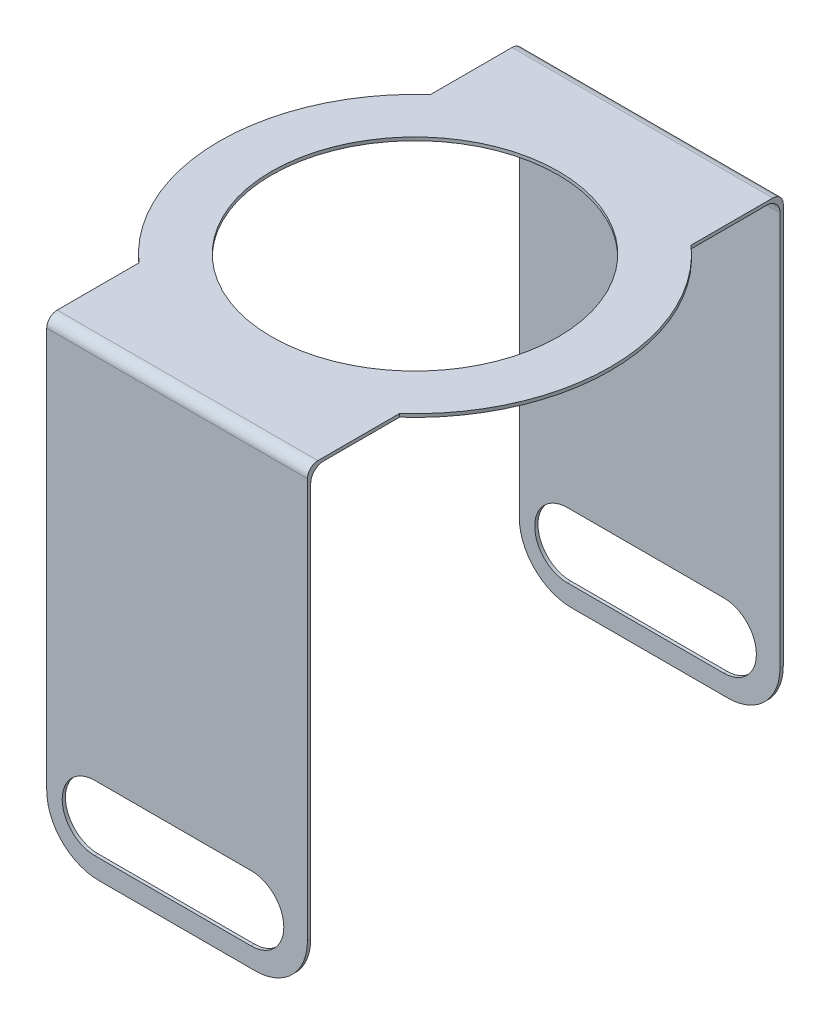
ISO-10303-21;
HEADER;
FILE_DESCRIPTION(('STEP AP214'),'2;1');
FILE_NAME('part.step','',(''),(''),'','','');
FILE_SCHEMA(('AUTOMOTIVE_DESIGN { 1 0 10303 214 1 1 1 1 }'));
ENDSEC;
DATA;
#1=APPLICATION_CONTEXT('core data for automotive mechanical design processes');
#2=APPLICATION_PROTOCOL_DEFINITION('international standard','automotive_design',2000,#1);
#3=PRODUCT_CONTEXT('',#1,'mechanical');
#4=PRODUCT('Part','Part','',(#3));
#5=PRODUCT_RELATED_PRODUCT_CATEGORY('part','',(#4));
#6=PRODUCT_DEFINITION_FORMATION('','',#4);
#7=PRODUCT_DEFINITION_CONTEXT('part definition',#1,'design');
#8=PRODUCT_DEFINITION('design','',#6,#7);
#9=PRODUCT_DEFINITION_SHAPE('','',#8);
#10=(LENGTH_UNIT() NAMED_UNIT(*) SI_UNIT(.MILLI.,.METRE.));
#11=(NAMED_UNIT(*) PLANE_ANGLE_UNIT() SI_UNIT($,.RADIAN.));
#12=(NAMED_UNIT(*) SI_UNIT($,.STERADIAN.) SOLID_ANGLE_UNIT());
#13=UNCERTAINTY_MEASURE_WITH_UNIT(LENGTH_MEASURE(1.E-05),#10,'distance_accuracy_value','');
#14=(GEOMETRIC_REPRESENTATION_CONTEXT(3) GLOBAL_UNCERTAINTY_ASSIGNED_CONTEXT((#13)) GLOBAL_UNIT_ASSIGNED_CONTEXT((#10,
#11,#12)) REPRESENTATION_CONTEXT('',''));
#15=CARTESIAN_POINT('',(0.,0.,0.));
#16=DIRECTION('',(0.,0.,1.));
#17=DIRECTION('',(1.,0.,0.));
#18=AXIS2_PLACEMENT_3D('',#15,#16,#17);
#19=CARTESIAN_POINT('',(0.,0.125,0.));
#20=DIRECTION('',(0.,1.,0.));
#21=DIRECTION('',(0.,0.,1.));
#22=AXIS2_PLACEMENT_3D('',#19,#20,#21);
#23=PLANE('',#22);
#24=DIRECTION('',(0.,0.,1.));
#25=VECTOR('',#24,1.);
#26=CARTESIAN_POINT('',(5.,0.125,0.));
#27=LINE('',#26,#25);
#28=CARTESIAN_POINT('',(5.,0.125,-8.725));
#29=VERTEX_POINT('',#28);
#30=CARTESIAN_POINT('',(5.,0.125,-5.59016994374947));
#31=VERTEX_POINT('',#30);
#32=EDGE_CURVE('E238',#29,#31,#27,.T.);
#33=ORIENTED_EDGE('',*,*,#32,.F.);
#34=DIRECTION('',(1.,0.,0.));
#35=VECTOR('',#34,1.);
#36=CARTESIAN_POINT('',(0.,0.125,-8.725));
#37=LINE('',#36,#35);
#38=CARTESIAN_POINT('',(-5.,0.125,-8.72500000000001));
#39=VERTEX_POINT('',#38);
#40=EDGE_CURVE('E401',#29,#39,#37,.F.);
#41=ORIENTED_EDGE('',*,*,#40,.T.);
#42=DIRECTION('',(0.,0.,1.));
#43=VECTOR('',#42,1.);
#44=CARTESIAN_POINT('',(-5.,0.125,0.));
#45=LINE('',#44,#43);
#46=CARTESIAN_POINT('',(-5.,0.125,-5.59016994374947));
#47=VERTEX_POINT('',#46);
#48=EDGE_CURVE('E260',#39,#47,#45,.T.);
#49=ORIENTED_EDGE('',*,*,#48,.T.);
#50=CARTESIAN_POINT('',(0.,0.125,0.));
#51=DIRECTION('',(0.,1.,0.));
#52=DIRECTION('',(0.,0.,1.));
#53=AXIS2_PLACEMENT_3D('',#50,#51,#52);
#54=CIRCLE('',#53,7.5);
#55=CARTESIAN_POINT('',(-5.,0.125,5.59016994374947));
#56=VERTEX_POINT('',#55);
#57=EDGE_CURVE('E257',#47,#56,#54,.T.);
#58=ORIENTED_EDGE('',*,*,#57,.T.);
#59=DIRECTION('',(0.,0.,1.));
#60=VECTOR('',#59,1.);
#61=CARTESIAN_POINT('',(-5.,0.125,0.));
#62=LINE('',#61,#60);
#63=CARTESIAN_POINT('',(-5.,0.125,8.72500000000001));
#64=VERTEX_POINT('',#63);
#65=EDGE_CURVE('E254',#56,#64,#62,.T.);
#66=ORIENTED_EDGE('',*,*,#65,.T.);
#67=DIRECTION('',(1.,0.,0.));
#68=VECTOR('',#67,1.);
#69=CARTESIAN_POINT('',(0.,0.125,8.725));
#70=LINE('',#69,#68);
#71=CARTESIAN_POINT('',(5.,0.125,8.725));
#72=VERTEX_POINT('',#71);
#73=EDGE_CURVE('E381',#64,#72,#70,.T.);
#74=ORIENTED_EDGE('',*,*,#73,.T.);
#75=DIRECTION('',(0.,0.,1.));
#76=VECTOR('',#75,1.);
#77=CARTESIAN_POINT('',(5.,0.125,0.));
#78=LINE('',#77,#76);
#79=CARTESIAN_POINT('',(5.,0.125,5.59016994374947));
#80=VERTEX_POINT('',#79);
#81=EDGE_CURVE('E235',#80,#72,#78,.T.);
#82=ORIENTED_EDGE('',*,*,#81,.F.);
#83=CARTESIAN_POINT('',(0.,0.125,0.));
#84=DIRECTION('',(0.,1.,0.));
#85=DIRECTION('',(0.,0.,1.));
#86=AXIS2_PLACEMENT_3D('',#83,#84,#85);
#87=CIRCLE('',#86,7.5);
#88=EDGE_CURVE('E229',#80,#31,#87,.T.);
#89=ORIENTED_EDGE('',*,*,#88,.T.);
#90=EDGE_LOOP('',(#33,#41,#49,#58,#66,#74,#82,#89));
#91=FACE_BOUND('',#90,.T.);
#92=CARTESIAN_POINT('',(0.,0.125,0.));
#93=DIRECTION('',(0.,-1.,0.));
#94=DIRECTION('',(0.,0.,1.));
#95=AXIS2_PLACEMENT_3D('',#92,#93,#94);
#96=CIRCLE('',#95,5.5);
#97=CARTESIAN_POINT('',(0.,0.125,5.5));
#98=VERTEX_POINT('',#97);
#99=EDGE_CURVE('E367',#98,#98,#96,.T.);
#100=ORIENTED_EDGE('',*,*,#99,.T.);
#101=EDGE_LOOP('',(#100));
#102=FACE_BOUND('',#101,.T.);
#103=ADVANCED_FACE('F37',(#91,#102),#23,.T.);
#104=CARTESIAN_POINT('',(0.,0.,0.));
#105=DIRECTION('',(0.,1.,0.));
#106=DIRECTION('',(0.,0.,1.));
#107=AXIS2_PLACEMENT_3D('',#104,#105,#106);
#108=PLANE('',#107);
#109=DIRECTION('',(1.,0.,0.));
#110=VECTOR('',#109,1.);
#111=CARTESIAN_POINT('',(0.,0.,-8.5));
#112=LINE('',#111,#110);
#113=CARTESIAN_POINT('',(-5.,0.,-8.5));
#114=VERTEX_POINT('',#113);
#115=CARTESIAN_POINT('',(5.,0.,-8.5));
#116=VERTEX_POINT('',#115);
#117=EDGE_CURVE('E392',#114,#116,#112,.T.);
#118=ORIENTED_EDGE('',*,*,#117,.T.);
#119=DIRECTION('',(0.,0.,1.));
#120=VECTOR('',#119,1.);
#121=CARTESIAN_POINT('',(5.,0.,0.));
#122=LINE('',#121,#120);
#123=CARTESIAN_POINT('',(5.,0.,-5.59016994374947));
#124=VERTEX_POINT('',#123);
#125=EDGE_CURVE('E281',#116,#124,#122,.T.);
#126=ORIENTED_EDGE('',*,*,#125,.T.);
#127=CARTESIAN_POINT('',(0.,0.,0.));
#128=DIRECTION('',(0.,1.,0.));
#129=DIRECTION('',(0.,0.,1.));
#130=AXIS2_PLACEMENT_3D('',#127,#128,#129);
#131=CIRCLE('',#130,7.5);
#132=CARTESIAN_POINT('',(5.,0.,5.59016994374947));
#133=VERTEX_POINT('',#132);
#134=EDGE_CURVE('E232',#133,#124,#131,.T.);
#135=ORIENTED_EDGE('',*,*,#134,.F.);
#136=DIRECTION('',(0.,0.,1.));
#137=VECTOR('',#136,1.);
#138=CARTESIAN_POINT('',(5.,0.,0.));
#139=LINE('',#138,#137);
#140=CARTESIAN_POINT('',(5.,0.,8.5));
#141=VERTEX_POINT('',#140);
#142=EDGE_CURVE('E295',#133,#141,#139,.T.);
#143=ORIENTED_EDGE('',*,*,#142,.T.);
#144=DIRECTION('',(1.,0.,0.));
#145=VECTOR('',#144,1.);
#146=CARTESIAN_POINT('',(0.,0.,8.5));
#147=LINE('',#146,#145);
#148=CARTESIAN_POINT('',(-5.,0.,8.5));
#149=VERTEX_POINT('',#148);
#150=EDGE_CURVE('E389',#141,#149,#147,.F.);
#151=ORIENTED_EDGE('',*,*,#150,.T.);
#152=DIRECTION('',(0.,0.,1.));
#153=VECTOR('',#152,1.);
#154=CARTESIAN_POINT('',(-5.,0.,0.));
#155=LINE('',#154,#153);
#156=CARTESIAN_POINT('',(-5.,0.,5.59016994374947));
#157=VERTEX_POINT('',#156);
#158=EDGE_CURVE('E285',#157,#149,#155,.T.);
#159=ORIENTED_EDGE('',*,*,#158,.F.);
#160=CARTESIAN_POINT('',(0.,0.,0.));
#161=DIRECTION('',(0.,1.,0.));
#162=DIRECTION('',(0.,0.,1.));
#163=AXIS2_PLACEMENT_3D('',#160,#161,#162);
#164=CIRCLE('',#163,7.5);
#165=CARTESIAN_POINT('',(-5.,0.,-5.59016994374947));
#166=VERTEX_POINT('',#165);
#167=EDGE_CURVE('E413',#166,#157,#164,.T.);
#168=ORIENTED_EDGE('',*,*,#167,.F.);
#169=DIRECTION('',(0.,0.,1.));
#170=VECTOR('',#169,1.);
#171=CARTESIAN_POINT('',(-5.,0.,0.));
#172=LINE('',#171,#170);
#173=EDGE_CURVE('E272',#114,#166,#172,.T.);
#174=ORIENTED_EDGE('',*,*,#173,.F.);
#175=EDGE_LOOP('',(#118,#126,#135,#143,#151,#159,#168,#174));
#176=FACE_BOUND('',#175,.T.);
#177=CARTESIAN_POINT('',(0.,0.,0.));
#178=DIRECTION('',(0.,-1.,0.));
#179=DIRECTION('',(0.,0.,1.));
#180=AXIS2_PLACEMENT_3D('',#177,#178,#179);
#181=CIRCLE('',#180,5.5);
#182=CARTESIAN_POINT('',(0.,0.,5.5));
#183=VERTEX_POINT('',#182);
#184=EDGE_CURVE('E366',#183,#183,#181,.T.);
#185=ORIENTED_EDGE('',*,*,#184,.F.);
#186=EDGE_LOOP('',(#185));
#187=FACE_BOUND('',#186,.T.);
#188=ADVANCED_FACE('F466',(#176,#187),#108,.F.);
#189=CARTESIAN_POINT('',(-7.88345399936903,0.125,9.00000000000001));
#190=DIRECTION('',(0.,0.,-1.));
#191=DIRECTION('',(-1.,0.,0.));
#192=AXIS2_PLACEMENT_3D('',#189,#190,#191);
#193=PLANE('',#192);
#194=DIRECTION('',(0.,1.,0.));
#195=VECTOR('',#194,1.);
#196=CARTESIAN_POINT('',(5.,0.125,9.));
#197=LINE('',#196,#195);
#198=CARTESIAN_POINT('',(5.,-15.6249999999997,9.));
#199=VERTEX_POINT('',#198);
#200=CARTESIAN_POINT('',(5.,-0.5,9.));
#201=VERTEX_POINT('',#200);
#202=EDGE_CURVE('E293',#199,#201,#197,.T.);
#203=ORIENTED_EDGE('',*,*,#202,.F.);
#204=CARTESIAN_POINT('',(3.,-15.6249999999997,9.));
#205=DIRECTION('',(0.,0.,-1.));
#206=DIRECTION('',(-1.,0.,0.));
#207=AXIS2_PLACEMENT_3D('',#204,#205,#206);
#208=CIRCLE('',#207,2.);
#209=CARTESIAN_POINT('',(3.,-17.6249999999997,9.));
#210=VERTEX_POINT('',#209);
#211=EDGE_CURVE('E429',#199,#210,#208,.T.);
#212=ORIENTED_EDGE('',*,*,#211,.T.);
#213=DIRECTION('',(1.,0.,0.));
#214=VECTOR('',#213,1.);
#215=CARTESIAN_POINT('',(-7.88345399936903,-17.6249999999997,9.00000000000001));
#216=LINE('',#215,#214);
#217=CARTESIAN_POINT('',(-3.,-17.6249999999997,9.));
#218=VERTEX_POINT('',#217);
#219=EDGE_CURVE('E360',#218,#210,#216,.T.);
#220=ORIENTED_EDGE('',*,*,#219,.F.);
#221=CARTESIAN_POINT('',(-3.,-15.6249999999997,9.));
#222=DIRECTION('',(0.,0.,-1.));
#223=DIRECTION('',(-1.,0.,0.));
#224=AXIS2_PLACEMENT_3D('',#221,#222,#223);
#225=CIRCLE('',#224,2.);
#226=CARTESIAN_POINT('',(-5.,-15.6249999999997,9.00000000000001));
#227=VERTEX_POINT('',#226);
#228=EDGE_CURVE('E427',#218,#227,#225,.T.);
#229=ORIENTED_EDGE('',*,*,#228,.T.);
#230=DIRECTION('',(0.,1.,0.));
#231=VECTOR('',#230,1.);
#232=CARTESIAN_POINT('',(-5.,0.125,9.00000000000001));
#233=LINE('',#232,#231);
#234=CARTESIAN_POINT('',(-5.,-0.5,9.00000000000001));
#235=VERTEX_POINT('',#234);
#236=EDGE_CURVE('E283',#227,#235,#233,.T.);
#237=ORIENTED_EDGE('',*,*,#236,.T.);
#238=DIRECTION('',(1.,0.,0.));
#239=VECTOR('',#238,1.);
#240=CARTESIAN_POINT('',(-7.88345399936903,-0.5,9.00000000000001));
#241=LINE('',#240,#239);
#242=EDGE_CURVE('E386',#235,#201,#241,.T.);
#243=ORIENTED_EDGE('',*,*,#242,.T.);
#244=EDGE_LOOP('',(#203,#212,#220,#229,#237,#243));
#245=FACE_BOUND('',#244,.T.);
#246=CARTESIAN_POINT('',(-3.15692218606275,-15.6249999999997,9.));
#247=DIRECTION('',(0.,0.,-1.));
#248=DIRECTION('',(-1.,0.,0.));
#249=AXIS2_PLACEMENT_3D('',#246,#247,#248);
#250=CIRCLE('',#249,1.25);
#251=CARTESIAN_POINT('',(-3.15692218606275,-16.8749999999997,9.));
#252=VERTEX_POINT('',#251);
#253=CARTESIAN_POINT('',(-3.15692218606275,-14.3749999999997,9.));
#254=VERTEX_POINT('',#253);
#255=EDGE_CURVE('E358',#252,#254,#250,.T.);
#256=ORIENTED_EDGE('',*,*,#255,.F.);
#257=DIRECTION('',(-1.,0.,0.));
#258=VECTOR('',#257,1.);
#259=CARTESIAN_POINT('',(-7.88345399936903,-16.8749999999997,9.00000000000001));
#260=LINE('',#259,#258);
#261=CARTESIAN_POINT('',(2.84307781393725,-16.8749999999997,9.));
#262=VERTEX_POINT('',#261);
#263=EDGE_CURVE('E348',#262,#252,#260,.T.);
#264=ORIENTED_EDGE('',*,*,#263,.F.);
#265=CARTESIAN_POINT('',(2.84307781393725,-15.6249999999997,9.));
#266=DIRECTION('',(0.,0.,-1.));
#267=DIRECTION('',(-1.,0.,0.));
#268=AXIS2_PLACEMENT_3D('',#265,#266,#267);
#269=CIRCLE('',#268,1.25);
#270=CARTESIAN_POINT('',(2.84307781393725,-14.3749999999997,9.));
#271=VERTEX_POINT('',#270);
#272=EDGE_CURVE('E353',#271,#262,#269,.T.);
#273=ORIENTED_EDGE('',*,*,#272,.F.);
#274=DIRECTION('',(1.,0.,0.));
#275=VECTOR('',#274,1.);
#276=CARTESIAN_POINT('',(-7.88345399936903,-14.3749999999997,9.00000000000001));
#277=LINE('',#276,#275);
#278=EDGE_CURVE('E356',#254,#271,#277,.T.);
#279=ORIENTED_EDGE('',*,*,#278,.F.);
#280=EDGE_LOOP('',(#256,#264,#273,#279));
#281=FACE_BOUND('',#280,.T.);
#282=ADVANCED_FACE('F495',(#245,#281),#193,.T.);
#283=CARTESIAN_POINT('',(-7.88345399936903,0.125,9.12500000000001));
#284=DIRECTION('',(0.,0.,1.));
#285=DIRECTION('',(1.,0.,0.));
#286=AXIS2_PLACEMENT_3D('',#283,#284,#285);
#287=PLANE('',#286);
#288=DIRECTION('',(-1.,0.,0.));
#289=VECTOR('',#288,1.);
#290=CARTESIAN_POINT('',(7.88345399936904,-17.6249999999997,9.125));
#291=LINE('',#290,#289);
#292=CARTESIAN_POINT('',(3.,-17.6249999999997,9.125));
#293=VERTEX_POINT('',#292);
#294=CARTESIAN_POINT('',(-3.,-17.6249999999997,9.125));
#295=VERTEX_POINT('',#294);
#296=EDGE_CURVE('E363',#293,#295,#291,.T.);
#297=ORIENTED_EDGE('',*,*,#296,.F.);
#298=CARTESIAN_POINT('',(3.,-15.6249999999997,9.125));
#299=DIRECTION('',(0.,0.,1.));
#300=DIRECTION('',(1.,0.,0.));
#301=AXIS2_PLACEMENT_3D('',#298,#299,#300);
#302=CIRCLE('',#301,2.);
#303=CARTESIAN_POINT('',(5.,-15.6249999999997,9.125));
#304=VERTEX_POINT('',#303);
#305=EDGE_CURVE('E423',#293,#304,#302,.T.);
#306=ORIENTED_EDGE('',*,*,#305,.T.);
#307=DIRECTION('',(0.,-1.,0.));
#308=VECTOR('',#307,1.);
#309=CARTESIAN_POINT('',(5.,0.125,9.125));
#310=LINE('',#309,#308);
#311=CARTESIAN_POINT('',(5.,-0.275,9.125));
#312=VERTEX_POINT('',#311);
#313=EDGE_CURVE('E300',#312,#304,#310,.T.);
#314=ORIENTED_EDGE('',*,*,#313,.F.);
#315=DIRECTION('',(1.,0.,0.));
#316=VECTOR('',#315,1.);
#317=CARTESIAN_POINT('',(-7.88345399936903,-0.275,9.12500000000001));
#318=LINE('',#317,#316);
#319=CARTESIAN_POINT('',(-5.,-0.275,9.12500000000001));
#320=VERTEX_POINT('',#319);
#321=EDGE_CURVE('E383',#312,#320,#318,.F.);
#322=ORIENTED_EDGE('',*,*,#321,.T.);
#323=DIRECTION('',(0.,-1.,0.));
#324=VECTOR('',#323,1.);
#325=CARTESIAN_POINT('',(-5.,0.125,9.12500000000001));
#326=LINE('',#325,#324);
#327=CARTESIAN_POINT('',(-5.,-15.6249999999997,9.12500000000001));
#328=VERTEX_POINT('',#327);
#329=EDGE_CURVE('E290',#320,#328,#326,.T.);
#330=ORIENTED_EDGE('',*,*,#329,.T.);
#331=CARTESIAN_POINT('',(-3.,-15.6249999999997,9.125));
#332=DIRECTION('',(0.,0.,1.));
#333=DIRECTION('',(1.,0.,0.));
#334=AXIS2_PLACEMENT_3D('',#331,#332,#333);
#335=CIRCLE('',#334,2.);
#336=EDGE_CURVE('E421',#328,#295,#335,.T.);
#337=ORIENTED_EDGE('',*,*,#336,.T.);
#338=EDGE_LOOP('',(#297,#306,#314,#322,#330,#337));
#339=FACE_BOUND('',#338,.T.);
#340=CARTESIAN_POINT('',(-3.15692218606275,-15.6249999999997,9.125));
#341=DIRECTION('',(0.,0.,1.));
#342=DIRECTION('',(1.,0.,0.));
#343=AXIS2_PLACEMENT_3D('',#340,#341,#342);
#344=CIRCLE('',#343,1.25);
#345=CARTESIAN_POINT('',(-3.15692218606275,-14.3749999999997,9.125));
#346=VERTEX_POINT('',#345);
#347=CARTESIAN_POINT('',(-3.15692218606275,-16.8749999999997,9.125));
#348=VERTEX_POINT('',#347);
#349=EDGE_CURVE('E378',#346,#348,#344,.T.);
#350=ORIENTED_EDGE('',*,*,#349,.F.);
#351=DIRECTION('',(1.,0.,0.));
#352=VECTOR('',#351,1.);
#353=CARTESIAN_POINT('',(-3.15692218606275,-14.3749999999997,9.125));
#354=LINE('',#353,#352);
#355=CARTESIAN_POINT('',(2.84307781393725,-14.3749999999997,9.125));
#356=VERTEX_POINT('',#355);
#357=EDGE_CURVE('E376',#356,#346,#354,.F.);
#358=ORIENTED_EDGE('',*,*,#357,.F.);
#359=CARTESIAN_POINT('',(2.84307781393725,-15.6249999999997,9.125));
#360=DIRECTION('',(0.,0.,1.));
#361=DIRECTION('',(1.,0.,0.));
#362=AXIS2_PLACEMENT_3D('',#359,#360,#361);
#363=CIRCLE('',#362,1.25);
#364=CARTESIAN_POINT('',(2.84307781393725,-16.8749999999997,9.125));
#365=VERTEX_POINT('',#364);
#366=EDGE_CURVE('E374',#365,#356,#363,.T.);
#367=ORIENTED_EDGE('',*,*,#366,.F.);
#368=DIRECTION('',(1.,0.,0.));
#369=VECTOR('',#368,1.);
#370=CARTESIAN_POINT('',(-3.15692218606275,-16.8749999999997,9.125));
#371=LINE('',#370,#369);
#372=EDGE_CURVE('E370',#348,#365,#371,.T.);
#373=ORIENTED_EDGE('',*,*,#372,.F.);
#374=EDGE_LOOP('',(#350,#358,#367,#373));
#375=FACE_BOUND('',#374,.T.);
#376=ADVANCED_FACE('F546',(#339,#375),#287,.T.);
#377=CARTESIAN_POINT('',(0.,-17.6249999999997,0.));
#378=DIRECTION('',(0.,-1.,0.));
#379=DIRECTION('',(0.,0.,-1.));
#380=AXIS2_PLACEMENT_3D('',#377,#378,#379);
#381=PLANE('',#380);
#382=ORIENTED_EDGE('',*,*,#219,.T.);
#383=DIRECTION('',(0.,0.,1.));
#384=VECTOR('',#383,1.);
#385=CARTESIAN_POINT('',(3.,-17.6249999999997,9.12500000000001));
#386=LINE('',#385,#384);
#387=EDGE_CURVE('E418',#210,#293,#386,.T.);
#388=ORIENTED_EDGE('',*,*,#387,.T.);
#389=ORIENTED_EDGE('',*,*,#296,.T.);
#390=DIRECTION('',(0.,0.,1.));
#391=VECTOR('',#390,1.);
#392=CARTESIAN_POINT('',(-3.,-17.6249999999997,0.));
#393=LINE('',#392,#391);
#394=EDGE_CURVE('E416',#295,#218,#393,.F.);
#395=ORIENTED_EDGE('',*,*,#394,.T.);
#396=EDGE_LOOP('',(#382,#388,#389,#395));
#397=FACE_BOUND('',#396,.T.);
#398=ADVANCED_FACE('F544',(#397),#381,.T.);
#399=CARTESIAN_POINT('',(-7.88345399936903,0.125,-9.00000000000001));
#400=DIRECTION('',(0.,0.,1.));
#401=DIRECTION('',(-1.,0.,0.));
#402=AXIS2_PLACEMENT_3D('',#399,#400,#401);
#403=PLANE('',#402);
#404=DIRECTION('',(1.,0.,0.));
#405=VECTOR('',#404,1.);
#406=CARTESIAN_POINT('',(-7.88345399936903,-17.6249999999997,-9.00000000000001));
#407=LINE('',#406,#405);
#408=CARTESIAN_POINT('',(-3.,-17.6249999999997,-9.));
#409=VERTEX_POINT('',#408);
#410=CARTESIAN_POINT('',(3.,-17.6249999999997,-9.));
#411=VERTEX_POINT('',#410);
#412=EDGE_CURVE('E323',#409,#411,#407,.T.);
#413=ORIENTED_EDGE('',*,*,#412,.T.);
#414=CARTESIAN_POINT('',(3.,-15.6249999999997,-9.));
#415=DIRECTION('',(0.,0.,1.));
#416=DIRECTION('',(1.,0.,0.));
#417=AXIS2_PLACEMENT_3D('',#414,#415,#416);
#418=CIRCLE('',#417,2.);
#419=CARTESIAN_POINT('',(5.,-15.6249999999997,-9.));
#420=VERTEX_POINT('',#419);
#421=EDGE_CURVE('E441',#411,#420,#418,.T.);
#422=ORIENTED_EDGE('',*,*,#421,.T.);
#423=DIRECTION('',(0.,-1.,0.));
#424=VECTOR('',#423,1.);
#425=CARTESIAN_POINT('',(5.,0.125,-9.));
#426=LINE('',#425,#424);
#427=CARTESIAN_POINT('',(5.,-0.5,-9.));
#428=VERTEX_POINT('',#427);
#429=EDGE_CURVE('E279',#428,#420,#426,.T.);
#430=ORIENTED_EDGE('',*,*,#429,.F.);
#431=DIRECTION('',(1.,0.,0.));
#432=VECTOR('',#431,1.);
#433=CARTESIAN_POINT('',(-7.88345399936903,-0.5,-9.00000000000001));
#434=LINE('',#433,#432);
#435=CARTESIAN_POINT('',(-5.,-0.5,-9.00000000000001));
#436=VERTEX_POINT('',#435);
#437=EDGE_CURVE('E395',#428,#436,#434,.F.);
#438=ORIENTED_EDGE('',*,*,#437,.T.);
#439=DIRECTION('',(0.,-1.,0.));
#440=VECTOR('',#439,1.);
#441=CARTESIAN_POINT('',(-5.,0.125,-9.00000000000001));
#442=LINE('',#441,#440);
#443=CARTESIAN_POINT('',(-5.,-15.6249999999997,-9.00000000000001));
#444=VERTEX_POINT('',#443);
#445=EDGE_CURVE('E269',#436,#444,#442,.T.);
#446=ORIENTED_EDGE('',*,*,#445,.T.);
#447=CARTESIAN_POINT('',(-3.,-15.6249999999997,-9.));
#448=DIRECTION('',(0.,0.,1.));
#449=DIRECTION('',(1.,0.,0.));
#450=AXIS2_PLACEMENT_3D('',#447,#448,#449);
#451=CIRCLE('',#450,2.);
#452=EDGE_CURVE('E439',#444,#409,#451,.T.);
#453=ORIENTED_EDGE('',*,*,#452,.T.);
#454=EDGE_LOOP('',(#413,#422,#430,#438,#446,#453));
#455=FACE_BOUND('',#454,.T.);
#456=CARTESIAN_POINT('',(-3.15692218606275,-15.6249999999997,-9.));
#457=DIRECTION('',(0.,0.,-1.));
#458=DIRECTION('',(-1.,0.,0.));
#459=AXIS2_PLACEMENT_3D('',#456,#457,#458);
#460=CIRCLE('',#459,1.25);
#461=CARTESIAN_POINT('',(-3.15692218606275,-16.8749999999997,-9.));
#462=VERTEX_POINT('',#461);
#463=CARTESIAN_POINT('',(-3.15692218606275,-14.3749999999997,-9.));
#464=VERTEX_POINT('',#463);
#465=EDGE_CURVE('E320',#462,#464,#460,.T.);
#466=ORIENTED_EDGE('',*,*,#465,.T.);
#467=DIRECTION('',(1.,0.,0.));
#468=VECTOR('',#467,1.);
#469=CARTESIAN_POINT('',(-7.88345399936903,-14.3749999999997,-9.00000000000001));
#470=LINE('',#469,#468);
#471=CARTESIAN_POINT('',(2.84307781393725,-14.3749999999997,-9.));
#472=VERTEX_POINT('',#471);
#473=EDGE_CURVE('E317',#464,#472,#470,.T.);
#474=ORIENTED_EDGE('',*,*,#473,.T.);
#475=CARTESIAN_POINT('',(2.84307781393725,-15.6249999999997,-9.));
#476=DIRECTION('',(0.,0.,-1.));
#477=DIRECTION('',(-1.,0.,0.));
#478=AXIS2_PLACEMENT_3D('',#475,#476,#477);
#479=CIRCLE('',#478,1.25);
#480=CARTESIAN_POINT('',(2.84307781393725,-16.8749999999997,-9.));
#481=VERTEX_POINT('',#480);
#482=EDGE_CURVE('E314',#472,#481,#479,.T.);
#483=ORIENTED_EDGE('',*,*,#482,.T.);
#484=DIRECTION('',(-1.,0.,0.));
#485=VECTOR('',#484,1.);
#486=CARTESIAN_POINT('',(-7.88345399936903,-16.8749999999997,-9.00000000000001));
#487=LINE('',#486,#485);
#488=EDGE_CURVE('E309',#481,#462,#487,.T.);
#489=ORIENTED_EDGE('',*,*,#488,.T.);
#490=EDGE_LOOP('',(#466,#474,#483,#489));
#491=FACE_BOUND('',#490,.T.);
#492=ADVANCED_FACE('F457',(#455,#491),#403,.T.);
#493=CARTESIAN_POINT('',(-7.88345399936903,0.125,-9.12500000000001));
#494=DIRECTION('',(0.,0.,-1.));
#495=DIRECTION('',(1.,0.,0.));
#496=AXIS2_PLACEMENT_3D('',#493,#494,#495);
#497=PLANE('',#496);
#498=DIRECTION('',(0.,1.,0.));
#499=VECTOR('',#498,1.);
#500=CARTESIAN_POINT('',(5.,0.125,-9.125));
#501=LINE('',#500,#499);
#502=CARTESIAN_POINT('',(5.,-15.6249999999997,-9.125));
#503=VERTEX_POINT('',#502);
#504=CARTESIAN_POINT('',(5.,-0.275,-9.125));
#505=VERTEX_POINT('',#504);
#506=EDGE_CURVE('E274',#503,#505,#501,.T.);
#507=ORIENTED_EDGE('',*,*,#506,.F.);
#508=CARTESIAN_POINT('',(3.,-15.6249999999997,-9.125));
#509=DIRECTION('',(0.,0.,-1.));
#510=DIRECTION('',(-1.,0.,0.));
#511=AXIS2_PLACEMENT_3D('',#508,#509,#510);
#512=CIRCLE('',#511,2.);
#513=CARTESIAN_POINT('',(3.,-17.6249999999997,-9.125));
#514=VERTEX_POINT('',#513);
#515=EDGE_CURVE('E45',#503,#514,#512,.T.);
#516=ORIENTED_EDGE('',*,*,#515,.T.);
#517=DIRECTION('',(-1.,0.,0.));
#518=VECTOR('',#517,1.);
#519=CARTESIAN_POINT('',(7.88345399936904,-17.6249999999997,-9.125));
#520=LINE('',#519,#518);
#521=CARTESIAN_POINT('',(-3.,-17.6249999999997,-9.125));
#522=VERTEX_POINT('',#521);
#523=EDGE_CURVE('E326',#514,#522,#520,.T.);
#524=ORIENTED_EDGE('',*,*,#523,.T.);
#525=CARTESIAN_POINT('',(-3.,-15.6249999999997,-9.125));
#526=DIRECTION('',(0.,0.,-1.));
#527=DIRECTION('',(-1.,0.,0.));
#528=AXIS2_PLACEMENT_3D('',#525,#526,#527);
#529=CIRCLE('',#528,2.);
#530=CARTESIAN_POINT('',(-5.,-15.6249999999997,-9.12500000000001));
#531=VERTEX_POINT('',#530);
#532=EDGE_CURVE('E52',#522,#531,#529,.T.);
#533=ORIENTED_EDGE('',*,*,#532,.T.);
#534=DIRECTION('',(0.,1.,0.));
#535=VECTOR('',#534,1.);
#536=CARTESIAN_POINT('',(-5.,0.125,-9.12500000000001));
#537=LINE('',#536,#535);
#538=CARTESIAN_POINT('',(-5.,-0.275,-9.12500000000001));
#539=VERTEX_POINT('',#538);
#540=EDGE_CURVE('E252',#531,#539,#537,.T.);
#541=ORIENTED_EDGE('',*,*,#540,.T.);
#542=DIRECTION('',(1.,0.,0.));
#543=VECTOR('',#542,1.);
#544=CARTESIAN_POINT('',(-7.88345399936903,-0.275,-9.12500000000001));
#545=LINE('',#544,#543);
#546=EDGE_CURVE('E398',#539,#505,#545,.T.);
#547=ORIENTED_EDGE('',*,*,#546,.T.);
#548=EDGE_LOOP('',(#507,#516,#524,#533,#541,#547));
#549=FACE_BOUND('',#548,.T.);
#550=CARTESIAN_POINT('',(-3.15692218606275,-15.6249999999997,-9.125));
#551=DIRECTION('',(0.,0.,1.));
#552=DIRECTION('',(1.,0.,0.));
#553=AXIS2_PLACEMENT_3D('',#550,#551,#552);
#554=CIRCLE('',#553,1.25);
#555=CARTESIAN_POINT('',(-3.15692218606275,-14.3749999999997,-9.125));
#556=VERTEX_POINT('',#555);
#557=CARTESIAN_POINT('',(-3.15692218606275,-16.8749999999997,-9.125));
#558=VERTEX_POINT('',#557);
#559=EDGE_CURVE('E337',#556,#558,#554,.T.);
#560=ORIENTED_EDGE('',*,*,#559,.T.);
#561=DIRECTION('',(1.,0.,0.));
#562=VECTOR('',#561,1.);
#563=CARTESIAN_POINT('',(-3.15692218606275,-16.8749999999997,-9.125));
#564=LINE('',#563,#562);
#565=CARTESIAN_POINT('',(2.84307781393725,-16.8749999999997,-9.125));
#566=VERTEX_POINT('',#565);
#567=EDGE_CURVE('E328',#558,#566,#564,.T.);
#568=ORIENTED_EDGE('',*,*,#567,.T.);
#569=CARTESIAN_POINT('',(2.84307781393725,-15.6249999999997,-9.125));
#570=DIRECTION('',(0.,0.,1.));
#571=DIRECTION('',(1.,0.,0.));
#572=AXIS2_PLACEMENT_3D('',#569,#570,#571);
#573=CIRCLE('',#572,1.25);
#574=CARTESIAN_POINT('',(2.84307781393725,-14.3749999999997,-9.125));
#575=VERTEX_POINT('',#574);
#576=EDGE_CURVE('E331',#566,#575,#573,.T.);
#577=ORIENTED_EDGE('',*,*,#576,.T.);
#578=DIRECTION('',(1.,0.,0.));
#579=VECTOR('',#578,1.);
#580=CARTESIAN_POINT('',(-3.15692218606275,-14.3749999999997,-9.125));
#581=LINE('',#580,#579);
#582=EDGE_CURVE('E334',#575,#556,#581,.F.);
#583=ORIENTED_EDGE('',*,*,#582,.T.);
#584=EDGE_LOOP('',(#560,#568,#577,#583));
#585=FACE_BOUND('',#584,.T.);
#586=ADVANCED_FACE('F446',(#549,#585),#497,.T.);
#587=CARTESIAN_POINT('',(0.,-17.6249999999997,0.));
#588=DIRECTION('',(0.,-1.,0.));
#589=DIRECTION('',(0.,0.,1.));
#590=AXIS2_PLACEMENT_3D('',#587,#588,#589);
#591=PLANE('',#590);
#592=ORIENTED_EDGE('',*,*,#523,.F.);
#593=DIRECTION('',(0.,0.,1.));
#594=VECTOR('',#593,1.);
#595=CARTESIAN_POINT('',(3.,-17.6249999999997,-9.));
#596=LINE('',#595,#594);
#597=EDGE_CURVE('E436',#514,#411,#596,.T.);
#598=ORIENTED_EDGE('',*,*,#597,.T.);
#599=ORIENTED_EDGE('',*,*,#412,.F.);
#600=DIRECTION('',(0.,0.,1.));
#601=VECTOR('',#600,1.);
#602=CARTESIAN_POINT('',(-3.,-17.6249999999997,0.));
#603=LINE('',#602,#601);
#604=EDGE_CURVE('E434',#409,#522,#603,.F.);
#605=ORIENTED_EDGE('',*,*,#604,.T.);
#606=EDGE_LOOP('',(#592,#598,#599,#605));
#607=FACE_BOUND('',#606,.T.);
#608=ADVANCED_FACE('F451',(#607),#591,.T.);
#609=CARTESIAN_POINT('',(0.,-0.275,8.725));
#610=DIRECTION('',(1.,0.,0.));
#611=DIRECTION('',(0.,0.,-1.));
#612=AXIS2_PLACEMENT_3D('',#609,#610,#611);
#613=CYLINDRICAL_SURFACE('',#612,0.4);
#614=CARTESIAN_POINT('',(5.,-0.275,8.725));
#615=DIRECTION('',(-1.,0.,0.));
#616=DIRECTION('',(0.,0.,1.));
#617=AXIS2_PLACEMENT_3D('',#614,#615,#616);
#618=CIRCLE('',#617,0.4);
#619=EDGE_CURVE('E298',#72,#312,#618,.F.);
#620=ORIENTED_EDGE('',*,*,#619,.F.);
#621=ORIENTED_EDGE('',*,*,#73,.F.);
#622=CARTESIAN_POINT('',(-5.,-0.275,8.72500000000001));
#623=DIRECTION('',(-1.,0.,0.));
#624=DIRECTION('',(0.,0.,1.));
#625=AXIS2_PLACEMENT_3D('',#622,#623,#624);
#626=CIRCLE('',#625,0.4);
#627=EDGE_CURVE('E287',#64,#320,#626,.F.);
#628=ORIENTED_EDGE('',*,*,#627,.T.);
#629=ORIENTED_EDGE('',*,*,#321,.F.);
#630=EDGE_LOOP('',(#620,#621,#628,#629));
#631=FACE_BOUND('',#630,.T.);
#632=ADVANCED_FACE('F505',(#631),#613,.T.);
#633=CARTESIAN_POINT('',(-7.88345399936903,-0.5,8.50000000000001));
#634=DIRECTION('',(1.,0.,0.));
#635=DIRECTION('',(0.,0.,-1.));
#636=AXIS2_PLACEMENT_3D('',#633,#634,#635);
#637=CYLINDRICAL_SURFACE('',#636,0.5);
#638=ORIENTED_EDGE('',*,*,#150,.F.);
#639=CARTESIAN_POINT('',(5.,-0.5,8.5));
#640=DIRECTION('',(-1.,0.,0.));
#641=DIRECTION('',(0.,0.,1.));
#642=AXIS2_PLACEMENT_3D('',#639,#640,#641);
#643=CIRCLE('',#642,0.5);
#644=EDGE_CURVE('E410',#141,#201,#643,.F.);
#645=ORIENTED_EDGE('',*,*,#644,.T.);
#646=ORIENTED_EDGE('',*,*,#242,.F.);
#647=CARTESIAN_POINT('',(-5.,-0.5,8.50000000000001));
#648=DIRECTION('',(-1.,0.,0.));
#649=DIRECTION('',(0.,0.,1.));
#650=AXIS2_PLACEMENT_3D('',#647,#648,#649);
#651=CIRCLE('',#650,0.5);
#652=EDGE_CURVE('E407',#149,#235,#651,.F.);
#653=ORIENTED_EDGE('',*,*,#652,.F.);
#654=EDGE_LOOP('',(#638,#645,#646,#653));
#655=FACE_BOUND('',#654,.T.);
#656=ADVANCED_FACE('F508',(#655),#637,.F.);
#657=CARTESIAN_POINT('',(0.,-0.5,-8.5));
#658=DIRECTION('',(1.,0.,0.));
#659=DIRECTION('',(0.,0.,-1.));
#660=AXIS2_PLACEMENT_3D('',#657,#658,#659);
#661=CYLINDRICAL_SURFACE('',#660,0.5);
#662=ORIENTED_EDGE('',*,*,#437,.F.);
#663=CARTESIAN_POINT('',(5.,-0.5,-8.5));
#664=DIRECTION('',(-1.,0.,0.));
#665=DIRECTION('',(0.,0.,1.));
#666=AXIS2_PLACEMENT_3D('',#663,#664,#665);
#667=CIRCLE('',#666,0.5);
#668=EDGE_CURVE('E276',#428,#116,#667,.F.);
#669=ORIENTED_EDGE('',*,*,#668,.T.);
#670=ORIENTED_EDGE('',*,*,#117,.F.);
#671=CARTESIAN_POINT('',(-5.,-0.5,-8.50000000000001));
#672=DIRECTION('',(-1.,0.,0.));
#673=DIRECTION('',(0.,0.,1.));
#674=AXIS2_PLACEMENT_3D('',#671,#672,#673);
#675=CIRCLE('',#674,0.5);
#676=EDGE_CURVE('E267',#436,#114,#675,.F.);
#677=ORIENTED_EDGE('',*,*,#676,.F.);
#678=EDGE_LOOP('',(#662,#669,#670,#677));
#679=FACE_BOUND('',#678,.T.);
#680=ADVANCED_FACE('F462',(#679),#661,.F.);
#681=CARTESIAN_POINT('',(-7.88345399936903,-0.275,-8.72500000000001));
#682=DIRECTION('',(1.,0.,0.));
#683=DIRECTION('',(0.,0.,-1.));
#684=AXIS2_PLACEMENT_3D('',#681,#682,#683);
#685=CYLINDRICAL_SURFACE('',#684,0.4);
#686=CARTESIAN_POINT('',(5.,-0.275,-8.725));
#687=DIRECTION('',(-1.,0.,0.));
#688=DIRECTION('',(0.,0.,1.));
#689=AXIS2_PLACEMENT_3D('',#686,#687,#688);
#690=CIRCLE('',#689,0.4);
#691=EDGE_CURVE('E241',#505,#29,#690,.F.);
#692=ORIENTED_EDGE('',*,*,#691,.F.);
#693=ORIENTED_EDGE('',*,*,#546,.F.);
#694=CARTESIAN_POINT('',(-5.,-0.275,-8.72500000000001));
#695=DIRECTION('',(-1.,0.,0.));
#696=DIRECTION('',(0.,0.,1.));
#697=AXIS2_PLACEMENT_3D('',#694,#695,#696);
#698=CIRCLE('',#697,0.4);
#699=EDGE_CURVE('E403',#539,#39,#698,.F.);
#700=ORIENTED_EDGE('',*,*,#699,.T.);
#701=ORIENTED_EDGE('',*,*,#40,.F.);
#702=EDGE_LOOP('',(#692,#693,#700,#701));
#703=FACE_BOUND('',#702,.T.);
#704=ADVANCED_FACE('F481',(#703),#685,.T.);
#705=CARTESIAN_POINT('',(0.,0.125,0.));
#706=DIRECTION('',(0.,-1.,0.));
#707=DIRECTION('',(0.,0.,-1.));
#708=AXIS2_PLACEMENT_3D('',#705,#706,#707);
#709=CYLINDRICAL_SURFACE('',#708,5.5);
#710=ORIENTED_EDGE('',*,*,#184,.T.);
#711=EDGE_LOOP('',(#710));
#712=FACE_BOUND('',#711,.T.);
#713=ORIENTED_EDGE('',*,*,#99,.F.);
#714=EDGE_LOOP('',(#713));
#715=FACE_BOUND('',#714,.T.);
#716=ADVANCED_FACE('F500',(#712,#715),#709,.F.);
#717=CARTESIAN_POINT('',(-3.15692218606275,-15.6249999999997,0.));
#718=DIRECTION('',(0.,0.,1.));
#719=DIRECTION('',(1.,0.,0.));
#720=AXIS2_PLACEMENT_3D('',#717,#718,#719);
#721=CYLINDRICAL_SURFACE('',#720,1.25);
#722=ORIENTED_EDGE('',*,*,#255,.T.);
#723=DIRECTION('',(0.,0.,1.));
#724=VECTOR('',#723,1.);
#725=CARTESIAN_POINT('',(-3.15692218606275,-14.3749999999997,0.));
#726=LINE('',#725,#724);
#727=EDGE_CURVE('E344',#254,#346,#726,.T.);
#728=ORIENTED_EDGE('',*,*,#727,.T.);
#729=ORIENTED_EDGE('',*,*,#349,.T.);
#730=DIRECTION('',(0.,0.,1.));
#731=VECTOR('',#730,1.);
#732=CARTESIAN_POINT('',(-3.15692218606275,-16.8749999999997,0.));
#733=LINE('',#732,#731);
#734=EDGE_CURVE('E340',#252,#348,#733,.T.);
#735=ORIENTED_EDGE('',*,*,#734,.F.);
#736=EDGE_LOOP('',(#722,#728,#729,#735));
#737=FACE_BOUND('',#736,.T.);
#738=ADVANCED_FACE('F503',(#737),#721,.F.);
#739=CARTESIAN_POINT('',(-3.15692218606275,-14.3749999999997,0.));
#740=DIRECTION('',(0.,1.,0.));
#741=DIRECTION('',(0.,0.,1.));
#742=AXIS2_PLACEMENT_3D('',#739,#740,#741);
#743=PLANE('',#742);
#744=ORIENTED_EDGE('',*,*,#278,.T.);
#745=DIRECTION('',(0.,0.,1.));
#746=VECTOR('',#745,1.);
#747=CARTESIAN_POINT('',(2.84307781393725,-14.3749999999997,0.));
#748=LINE('',#747,#746);
#749=EDGE_CURVE('E341',#271,#356,#748,.T.);
#750=ORIENTED_EDGE('',*,*,#749,.T.);
#751=ORIENTED_EDGE('',*,*,#357,.T.);
#752=ORIENTED_EDGE('',*,*,#727,.F.);
#753=EDGE_LOOP('',(#744,#750,#751,#752));
#754=FACE_BOUND('',#753,.T.);
#755=ADVANCED_FACE('F590',(#754),#743,.F.);
#756=CARTESIAN_POINT('',(2.84307781393725,-15.6249999999997,0.));
#757=DIRECTION('',(0.,0.,1.));
#758=DIRECTION('',(1.,0.,0.));
#759=AXIS2_PLACEMENT_3D('',#756,#757,#758);
#760=CYLINDRICAL_SURFACE('',#759,1.25);
#761=ORIENTED_EDGE('',*,*,#272,.T.);
#762=DIRECTION('',(0.,0.,1.));
#763=VECTOR('',#762,1.);
#764=CARTESIAN_POINT('',(2.84307781393725,-16.8749999999997,0.));
#765=LINE('',#764,#763);
#766=EDGE_CURVE('E345',#262,#365,#765,.T.);
#767=ORIENTED_EDGE('',*,*,#766,.T.);
#768=ORIENTED_EDGE('',*,*,#366,.T.);
#769=ORIENTED_EDGE('',*,*,#749,.F.);
#770=EDGE_LOOP('',(#761,#767,#768,#769));
#771=FACE_BOUND('',#770,.T.);
#772=ADVANCED_FACE('F593',(#771),#760,.F.);
#773=CARTESIAN_POINT('',(-3.15692218606275,-16.8749999999997,0.));
#774=DIRECTION('',(0.,-1.,0.));
#775=DIRECTION('',(0.,0.,-1.));
#776=AXIS2_PLACEMENT_3D('',#773,#774,#775);
#777=PLANE('',#776);
#778=ORIENTED_EDGE('',*,*,#263,.T.);
#779=ORIENTED_EDGE('',*,*,#734,.T.);
#780=ORIENTED_EDGE('',*,*,#372,.T.);
#781=ORIENTED_EDGE('',*,*,#766,.F.);
#782=EDGE_LOOP('',(#778,#779,#780,#781));
#783=FACE_BOUND('',#782,.T.);
#784=ADVANCED_FACE('F582',(#783),#777,.F.);
#785=CARTESIAN_POINT('',(-3.15692218606275,-15.6249999999997,0.));
#786=DIRECTION('',(0.,0.,-1.));
#787=DIRECTION('',(1.,0.,0.));
#788=AXIS2_PLACEMENT_3D('',#785,#786,#787);
#789=CYLINDRICAL_SURFACE('',#788,1.25);
#790=ORIENTED_EDGE('',*,*,#465,.F.);
#791=DIRECTION('',(0.,0.,-1.));
#792=VECTOR('',#791,1.);
#793=CARTESIAN_POINT('',(-3.15692218606275,-16.8749999999997,0.));
#794=LINE('',#793,#792);
#795=EDGE_CURVE('E303',#462,#558,#794,.T.);
#796=ORIENTED_EDGE('',*,*,#795,.T.);
#797=ORIENTED_EDGE('',*,*,#559,.F.);
#798=DIRECTION('',(0.,0.,-1.));
#799=VECTOR('',#798,1.);
#800=CARTESIAN_POINT('',(-3.15692218606275,-14.3749999999997,0.));
#801=LINE('',#800,#799);
#802=EDGE_CURVE('E306',#464,#556,#801,.T.);
#803=ORIENTED_EDGE('',*,*,#802,.F.);
#804=EDGE_LOOP('',(#790,#796,#797,#803));
#805=FACE_BOUND('',#804,.T.);
#806=ADVANCED_FACE('F573',(#805),#789,.F.);
#807=CARTESIAN_POINT('',(-3.15692218606275,-14.3749999999997,0.));
#808=DIRECTION('',(0.,1.,0.));
#809=DIRECTION('',(0.,0.,-1.));
#810=AXIS2_PLACEMENT_3D('',#807,#808,#809);
#811=PLANE('',#810);
#812=ORIENTED_EDGE('',*,*,#473,.F.);
#813=ORIENTED_EDGE('',*,*,#802,.T.);
#814=ORIENTED_EDGE('',*,*,#582,.F.);
#815=DIRECTION('',(0.,0.,-1.));
#816=VECTOR('',#815,1.);
#817=CARTESIAN_POINT('',(2.84307781393725,-14.3749999999997,0.));
#818=LINE('',#817,#816);
#819=EDGE_CURVE('E304',#472,#575,#818,.T.);
#820=ORIENTED_EDGE('',*,*,#819,.F.);
#821=EDGE_LOOP('',(#812,#813,#814,#820));
#822=FACE_BOUND('',#821,.T.);
#823=ADVANCED_FACE('F569',(#822),#811,.F.);
#824=CARTESIAN_POINT('',(2.84307781393725,-15.6249999999997,0.));
#825=DIRECTION('',(0.,0.,-1.));
#826=DIRECTION('',(1.,0.,0.));
#827=AXIS2_PLACEMENT_3D('',#824,#825,#826);
#828=CYLINDRICAL_SURFACE('',#827,1.25);
#829=ORIENTED_EDGE('',*,*,#482,.F.);
#830=ORIENTED_EDGE('',*,*,#819,.T.);
#831=ORIENTED_EDGE('',*,*,#576,.F.);
#832=DIRECTION('',(0.,0.,-1.));
#833=VECTOR('',#832,1.);
#834=CARTESIAN_POINT('',(2.84307781393725,-16.8749999999997,0.));
#835=LINE('',#834,#833);
#836=EDGE_CURVE('E307',#481,#566,#835,.T.);
#837=ORIENTED_EDGE('',*,*,#836,.F.);
#838=EDGE_LOOP('',(#829,#830,#831,#837));
#839=FACE_BOUND('',#838,.T.);
#840=ADVANCED_FACE('F572',(#839),#828,.F.);
#841=CARTESIAN_POINT('',(-3.15692218606275,-16.8749999999997,0.));
#842=DIRECTION('',(0.,-1.,0.));
#843=DIRECTION('',(0.,0.,1.));
#844=AXIS2_PLACEMENT_3D('',#841,#842,#843);
#845=PLANE('',#844);
#846=ORIENTED_EDGE('',*,*,#488,.F.);
#847=ORIENTED_EDGE('',*,*,#836,.T.);
#848=ORIENTED_EDGE('',*,*,#567,.F.);
#849=ORIENTED_EDGE('',*,*,#795,.F.);
#850=EDGE_LOOP('',(#846,#847,#848,#849));
#851=FACE_BOUND('',#850,.T.);
#852=ADVANCED_FACE('F566',(#851),#845,.F.);
#853=CARTESIAN_POINT('',(0.,-17.6249999999997,0.));
#854=DIRECTION('',(0.,1.,0.));
#855=DIRECTION('',(0.,0.,1.));
#856=AXIS2_PLACEMENT_3D('',#853,#854,#855);
#857=CYLINDRICAL_SURFACE('',#856,7.5);
#858=ORIENTED_EDGE('',*,*,#167,.T.);
#859=DIRECTION('',(0.,1.,0.));
#860=VECTOR('',#859,1.);
#861=CARTESIAN_POINT('',(-5.,-17.6249999999997,5.59016994374947));
#862=LINE('',#861,#860);
#863=EDGE_CURVE('E263',#157,#56,#862,.T.);
#864=ORIENTED_EDGE('',*,*,#863,.T.);
#865=ORIENTED_EDGE('',*,*,#57,.F.);
#866=DIRECTION('',(0.,1.,0.));
#867=VECTOR('',#866,1.);
#868=CARTESIAN_POINT('',(-5.,-17.6249999999997,-5.59016994374947));
#869=LINE('',#868,#867);
#870=EDGE_CURVE('E245',#166,#47,#869,.T.);
#871=ORIENTED_EDGE('',*,*,#870,.F.);
#872=EDGE_LOOP('',(#858,#864,#865,#871));
#873=FACE_BOUND('',#872,.T.);
#874=ADVANCED_FACE('F475',(#873),#857,.T.);
#875=CARTESIAN_POINT('',(-5.,-17.6249999999997,0.));
#876=DIRECTION('',(-1.,0.,0.));
#877=DIRECTION('',(0.,0.,1.));
#878=AXIS2_PLACEMENT_3D('',#875,#876,#877);
#879=PLANE('',#878);
#880=ORIENTED_EDGE('',*,*,#236,.F.);
#881=DIRECTION('',(0.,0.,1.));
#882=VECTOR('',#881,1.);
#883=CARTESIAN_POINT('',(-5.,-15.6249999999997,0.));
#884=LINE('',#883,#882);
#885=EDGE_CURVE('E431',#227,#328,#884,.T.);
#886=ORIENTED_EDGE('',*,*,#885,.T.);
#887=ORIENTED_EDGE('',*,*,#329,.F.);
#888=ORIENTED_EDGE('',*,*,#627,.F.);
#889=ORIENTED_EDGE('',*,*,#65,.F.);
#890=ORIENTED_EDGE('',*,*,#863,.F.);
#891=ORIENTED_EDGE('',*,*,#158,.T.);
#892=ORIENTED_EDGE('',*,*,#652,.T.);
#893=EDGE_LOOP('',(#880,#886,#887,#888,#889,#890,#891,#892));
#894=FACE_BOUND('',#893,.T.);
#895=ADVANCED_FACE('F534',(#894),#879,.T.);
#896=CARTESIAN_POINT('',(-5.,-17.6249999999997,0.));
#897=DIRECTION('',(-1.,0.,0.));
#898=DIRECTION('',(0.,0.,1.));
#899=AXIS2_PLACEMENT_3D('',#896,#897,#898);
#900=PLANE('',#899);
#901=ORIENTED_EDGE('',*,*,#540,.F.);
#902=DIRECTION('',(0.,0.,1.));
#903=VECTOR('',#902,1.);
#904=CARTESIAN_POINT('',(-5.,-15.6249999999997,0.));
#905=LINE('',#904,#903);
#906=EDGE_CURVE('E11',#531,#444,#905,.T.);
#907=ORIENTED_EDGE('',*,*,#906,.T.);
#908=ORIENTED_EDGE('',*,*,#445,.F.);
#909=ORIENTED_EDGE('',*,*,#676,.T.);
#910=ORIENTED_EDGE('',*,*,#173,.T.);
#911=ORIENTED_EDGE('',*,*,#870,.T.);
#912=ORIENTED_EDGE('',*,*,#48,.F.);
#913=ORIENTED_EDGE('',*,*,#699,.F.);
#914=EDGE_LOOP('',(#901,#907,#908,#909,#910,#911,#912,#913));
#915=FACE_BOUND('',#914,.T.);
#916=ADVANCED_FACE('F472',(#915),#900,.T.);
#917=CARTESIAN_POINT('',(0.,-17.6249999999997,0.));
#918=DIRECTION('',(0.,1.,0.));
#919=DIRECTION('',(0.,0.,1.));
#920=AXIS2_PLACEMENT_3D('',#917,#918,#919);
#921=CYLINDRICAL_SURFACE('',#920,7.5);
#922=ORIENTED_EDGE('',*,*,#134,.T.);
#923=DIRECTION('',(0.,1.,0.));
#924=VECTOR('',#923,1.);
#925=CARTESIAN_POINT('',(5.,-17.6249999999997,-5.59016994374947));
#926=LINE('',#925,#924);
#927=EDGE_CURVE('E224',#124,#31,#926,.T.);
#928=ORIENTED_EDGE('',*,*,#927,.T.);
#929=ORIENTED_EDGE('',*,*,#88,.F.);
#930=DIRECTION('',(0.,1.,0.));
#931=VECTOR('',#930,1.);
#932=CARTESIAN_POINT('',(5.,-17.6249999999997,5.59016994374947));
#933=LINE('',#932,#931);
#934=EDGE_CURVE('E234',#133,#80,#933,.T.);
#935=ORIENTED_EDGE('',*,*,#934,.F.);
#936=EDGE_LOOP('',(#922,#928,#929,#935));
#937=FACE_BOUND('',#936,.T.);
#938=ADVANCED_FACE('F226',(#937),#921,.T.);
#939=CARTESIAN_POINT('',(5.,-17.6249999999997,0.));
#940=DIRECTION('',(-1.,0.,0.));
#941=DIRECTION('',(0.,0.,1.));
#942=AXIS2_PLACEMENT_3D('',#939,#940,#941);
#943=PLANE('',#942);
#944=ORIENTED_EDGE('',*,*,#313,.T.);
#945=DIRECTION('',(0.,0.,1.));
#946=VECTOR('',#945,1.);
#947=CARTESIAN_POINT('',(5.,-15.6249999999997,9.));
#948=LINE('',#947,#946);
#949=EDGE_CURVE('E425',#304,#199,#948,.F.);
#950=ORIENTED_EDGE('',*,*,#949,.T.);
#951=ORIENTED_EDGE('',*,*,#202,.T.);
#952=ORIENTED_EDGE('',*,*,#644,.F.);
#953=ORIENTED_EDGE('',*,*,#142,.F.);
#954=ORIENTED_EDGE('',*,*,#934,.T.);
#955=ORIENTED_EDGE('',*,*,#81,.T.);
#956=ORIENTED_EDGE('',*,*,#619,.T.);
#957=EDGE_LOOP('',(#944,#950,#951,#952,#953,#954,#955,#956));
#958=FACE_BOUND('',#957,.T.);
#959=ADVANCED_FACE('F552',(#958),#943,.F.);
#960=CARTESIAN_POINT('',(5.,-17.6249999999997,0.));
#961=DIRECTION('',(-1.,0.,0.));
#962=DIRECTION('',(0.,0.,1.));
#963=AXIS2_PLACEMENT_3D('',#960,#961,#962);
#964=PLANE('',#963);
#965=ORIENTED_EDGE('',*,*,#429,.T.);
#966=DIRECTION('',(0.,0.,1.));
#967=VECTOR('',#966,1.);
#968=CARTESIAN_POINT('',(5.,-15.6249999999997,-9.12500000000001));
#969=LINE('',#968,#967);
#970=EDGE_CURVE('E60',#420,#503,#969,.F.);
#971=ORIENTED_EDGE('',*,*,#970,.T.);
#972=ORIENTED_EDGE('',*,*,#506,.T.);
#973=ORIENTED_EDGE('',*,*,#691,.T.);
#974=ORIENTED_EDGE('',*,*,#32,.T.);
#975=ORIENTED_EDGE('',*,*,#927,.F.);
#976=ORIENTED_EDGE('',*,*,#125,.F.);
#977=ORIENTED_EDGE('',*,*,#668,.F.);
#978=EDGE_LOOP('',(#965,#971,#972,#973,#974,#975,#976,#977));
#979=FACE_BOUND('',#978,.T.);
#980=ADVANCED_FACE('F239',(#979),#964,.F.);
#981=CARTESIAN_POINT('',(3.,-15.6249999999997,0.));
#982=DIRECTION('',(0.,0.,-1.));
#983=DIRECTION('',(-1.,0.,0.));
#984=AXIS2_PLACEMENT_3D('',#981,#982,#983);
#985=CYLINDRICAL_SURFACE('',#984,2.);
#986=ORIENTED_EDGE('',*,*,#211,.F.);
#987=ORIENTED_EDGE('',*,*,#949,.F.);
#988=ORIENTED_EDGE('',*,*,#305,.F.);
#989=ORIENTED_EDGE('',*,*,#387,.F.);
#990=EDGE_LOOP('',(#986,#987,#988,#989));
#991=FACE_BOUND('',#990,.T.);
#992=ADVANCED_FACE('F517',(#991),#985,.T.);
#993=CARTESIAN_POINT('',(-3.,-15.6249999999997,0.));
#994=DIRECTION('',(0.,0.,1.));
#995=DIRECTION('',(1.,0.,0.));
#996=AXIS2_PLACEMENT_3D('',#993,#994,#995);
#997=CYLINDRICAL_SURFACE('',#996,2.);
#998=ORIENTED_EDGE('',*,*,#228,.F.);
#999=ORIENTED_EDGE('',*,*,#394,.F.);
#1000=ORIENTED_EDGE('',*,*,#336,.F.);
#1001=ORIENTED_EDGE('',*,*,#885,.F.);
#1002=EDGE_LOOP('',(#998,#999,#1000,#1001));
#1003=FACE_BOUND('',#1002,.T.);
#1004=ADVANCED_FACE('F488',(#1003),#997,.T.);
#1005=CARTESIAN_POINT('',(3.,-15.6249999999997,0.));
#1006=DIRECTION('',(0.,0.,-1.));
#1007=DIRECTION('',(-1.,0.,0.));
#1008=AXIS2_PLACEMENT_3D('',#1005,#1006,#1007);
#1009=CYLINDRICAL_SURFACE('',#1008,2.);
#1010=ORIENTED_EDGE('',*,*,#515,.F.);
#1011=ORIENTED_EDGE('',*,*,#970,.F.);
#1012=ORIENTED_EDGE('',*,*,#421,.F.);
#1013=ORIENTED_EDGE('',*,*,#597,.F.);
#1014=EDGE_LOOP('',(#1010,#1011,#1012,#1013));
#1015=FACE_BOUND('',#1014,.T.);
#1016=ADVANCED_FACE('F454',(#1015),#1009,.T.);
#1017=CARTESIAN_POINT('',(-3.,-15.6249999999997,0.));
#1018=DIRECTION('',(0.,0.,1.));
#1019=DIRECTION('',(1.,0.,0.));
#1020=AXIS2_PLACEMENT_3D('',#1017,#1018,#1019);
#1021=CYLINDRICAL_SURFACE('',#1020,2.);
#1022=ORIENTED_EDGE('',*,*,#532,.F.);
#1023=ORIENTED_EDGE('',*,*,#604,.F.);
#1024=ORIENTED_EDGE('',*,*,#452,.F.);
#1025=ORIENTED_EDGE('',*,*,#906,.F.);
#1026=EDGE_LOOP('',(#1022,#1023,#1024,#1025));
#1027=FACE_BOUND('',#1026,.T.);
#1028=ADVANCED_FACE('F39',(#1027),#1021,.T.);
#1029=CLOSED_SHELL('',(#103,#188,#282,#376,#398,#492,#586,#608,#632,#656,#680,#704,#716,#738,
#755,#772,#784,#806,#823,#840,#852,#874,#895,#916,#938,#959,#980,#992,#1004,#1016,#1028));
#1030=MANIFOLD_SOLID_BREP('B2',#1029);
#1031=ADVANCED_BREP_SHAPE_REPRESENTATION('',(#18,#1030),#14);
#1032=SHAPE_DEFINITION_REPRESENTATION(#9,#1031);
ENDSEC;
END-ISO-10303-21;
